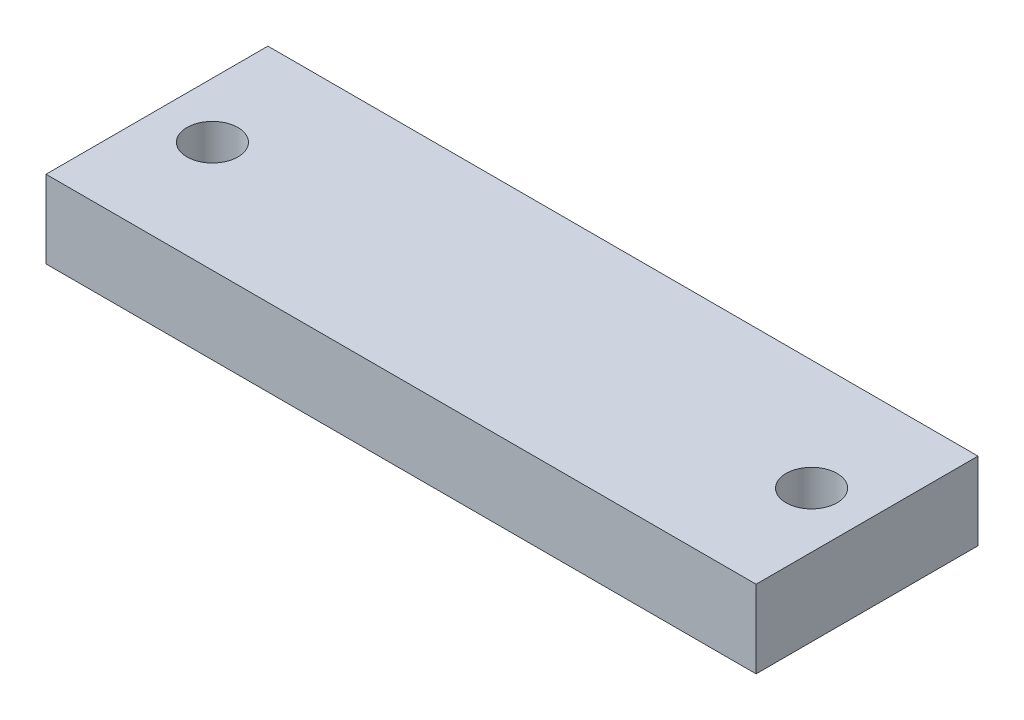
ISO-10303-21;
HEADER;
FILE_DESCRIPTION(('STEP AP214'),'2;1');
FILE_NAME('part.step','',(''),(''),'','','');
FILE_SCHEMA(('AUTOMOTIVE_DESIGN { 1 0 10303 214 1 1 1 1 }'));
ENDSEC;
DATA;
#1=APPLICATION_CONTEXT('core data for automotive mechanical design processes');
#2=APPLICATION_PROTOCOL_DEFINITION('international standard','automotive_design',2000,#1);
#3=PRODUCT_CONTEXT('',#1,'mechanical');
#4=PRODUCT('Part','Part','',(#3));
#5=PRODUCT_RELATED_PRODUCT_CATEGORY('part','',(#4));
#6=PRODUCT_DEFINITION_FORMATION('','',#4);
#7=PRODUCT_DEFINITION_CONTEXT('part definition',#1,'design');
#8=PRODUCT_DEFINITION('design','',#6,#7);
#9=PRODUCT_DEFINITION_SHAPE('','',#8);
#10=(LENGTH_UNIT() NAMED_UNIT(*) SI_UNIT(.MILLI.,.METRE.));
#11=(NAMED_UNIT(*) PLANE_ANGLE_UNIT() SI_UNIT($,.RADIAN.));
#12=(NAMED_UNIT(*) SI_UNIT($,.STERADIAN.) SOLID_ANGLE_UNIT());
#13=UNCERTAINTY_MEASURE_WITH_UNIT(LENGTH_MEASURE(1.E-05),#10,'distance_accuracy_value','');
#14=(GEOMETRIC_REPRESENTATION_CONTEXT(3) GLOBAL_UNCERTAINTY_ASSIGNED_CONTEXT((#13)) GLOBAL_UNIT_ASSIGNED_CONTEXT((#10,
#11,#12)) REPRESENTATION_CONTEXT('',''));
#15=CARTESIAN_POINT('',(0.,0.,0.));
#16=DIRECTION('',(0.,0.,1.));
#17=DIRECTION('',(1.,0.,0.));
#18=AXIS2_PLACEMENT_3D('',#15,#16,#17);
#19=CARTESIAN_POINT('',(0.,7.,0.));
#20=DIRECTION('',(0.,0.,-1.));
#21=DIRECTION('',(-1.,0.,0.));
#22=AXIS2_PLACEMENT_3D('',#19,#20,#21);
#23=PLANE('',#22);
#24=DIRECTION('',(1.,0.,0.));
#25=VECTOR('',#24,1.);
#26=CARTESIAN_POINT('',(0.,0.,0.));
#27=LINE('',#26,#25);
#28=CARTESIAN_POINT('',(0.,0.,0.));
#29=VERTEX_POINT('',#28);
#30=CARTESIAN_POINT('',(64.,0.,0.));
#31=VERTEX_POINT('',#30);
#32=EDGE_CURVE('E122',#29,#31,#27,.T.);
#33=ORIENTED_EDGE('',*,*,#32,.T.);
#34=DIRECTION('',(0.,-1.,0.));
#35=VECTOR('',#34,1.);
#36=CARTESIAN_POINT('',(64.,7.,0.));
#37=LINE('',#36,#35);
#38=CARTESIAN_POINT('',(64.,7.,0.));
#39=VERTEX_POINT('',#38);
#40=EDGE_CURVE('E11',#39,#31,#37,.T.);
#41=ORIENTED_EDGE('',*,*,#40,.F.);
#42=DIRECTION('',(1.,0.,0.));
#43=VECTOR('',#42,1.);
#44=CARTESIAN_POINT('',(0.,7.,0.));
#45=LINE('',#44,#43);
#46=CARTESIAN_POINT('',(0.,7.,0.));
#47=VERTEX_POINT('',#46);
#48=EDGE_CURVE('E96',#47,#39,#45,.T.);
#49=ORIENTED_EDGE('',*,*,#48,.F.);
#50=DIRECTION('',(0.,-1.,0.));
#51=VECTOR('',#50,1.);
#52=CARTESIAN_POINT('',(0.,7.,0.));
#53=LINE('',#52,#51);
#54=EDGE_CURVE('E63',#47,#29,#53,.T.);
#55=ORIENTED_EDGE('',*,*,#54,.T.);
#56=EDGE_LOOP('',(#33,#41,#49,#55));
#57=FACE_BOUND('',#56,.T.);
#58=ADVANCED_FACE('F45',(#57),#23,.F.);
#59=CARTESIAN_POINT('',(64.,7.,0.));
#60=DIRECTION('',(-1.,0.,0.));
#61=DIRECTION('',(0.,0.,1.));
#62=AXIS2_PLACEMENT_3D('',#59,#60,#61);
#63=PLANE('',#62);
#64=DIRECTION('',(0.,0.,-1.));
#65=VECTOR('',#64,1.);
#66=CARTESIAN_POINT('',(64.,0.,0.));
#67=LINE('',#66,#65);
#68=CARTESIAN_POINT('',(64.,0.,-20.));
#69=VERTEX_POINT('',#68);
#70=EDGE_CURVE('E102',#31,#69,#67,.T.);
#71=ORIENTED_EDGE('',*,*,#70,.T.);
#72=DIRECTION('',(0.,-1.,0.));
#73=VECTOR('',#72,1.);
#74=CARTESIAN_POINT('',(64.,7.,-20.));
#75=LINE('',#74,#73);
#76=CARTESIAN_POINT('',(64.,7.,-20.));
#77=VERTEX_POINT('',#76);
#78=EDGE_CURVE('E55',#77,#69,#75,.T.);
#79=ORIENTED_EDGE('',*,*,#78,.F.);
#80=DIRECTION('',(0.,0.,-1.));
#81=VECTOR('',#80,1.);
#82=CARTESIAN_POINT('',(64.,7.,0.));
#83=LINE('',#82,#81);
#84=EDGE_CURVE('E88',#39,#77,#83,.T.);
#85=ORIENTED_EDGE('',*,*,#84,.F.);
#86=ORIENTED_EDGE('',*,*,#40,.T.);
#87=EDGE_LOOP('',(#71,#79,#85,#86));
#88=FACE_BOUND('',#87,.T.);
#89=ADVANCED_FACE('F101',(#88),#63,.F.);
#90=CARTESIAN_POINT('',(0.,7.,-20.));
#91=DIRECTION('',(0.,0.,-1.));
#92=DIRECTION('',(-1.,0.,0.));
#93=AXIS2_PLACEMENT_3D('',#90,#91,#92);
#94=PLANE('',#93);
#95=DIRECTION('',(1.,0.,0.));
#96=VECTOR('',#95,1.);
#97=CARTESIAN_POINT('',(0.,0.,-20.));
#98=LINE('',#97,#96);
#99=CARTESIAN_POINT('',(0.,0.,-20.));
#100=VERTEX_POINT('',#99);
#101=EDGE_CURVE('E127',#100,#69,#98,.T.);
#102=ORIENTED_EDGE('',*,*,#101,.F.);
#103=DIRECTION('',(0.,-1.,0.));
#104=VECTOR('',#103,1.);
#105=CARTESIAN_POINT('',(0.,7.,-20.));
#106=LINE('',#105,#104);
#107=CARTESIAN_POINT('',(0.,7.,-20.));
#108=VERTEX_POINT('',#107);
#109=EDGE_CURVE('E77',#108,#100,#106,.T.);
#110=ORIENTED_EDGE('',*,*,#109,.F.);
#111=DIRECTION('',(1.,0.,0.));
#112=VECTOR('',#111,1.);
#113=CARTESIAN_POINT('',(0.,7.,-20.));
#114=LINE('',#113,#112);
#115=EDGE_CURVE('E95',#108,#77,#114,.T.);
#116=ORIENTED_EDGE('',*,*,#115,.T.);
#117=ORIENTED_EDGE('',*,*,#78,.T.);
#118=EDGE_LOOP('',(#102,#110,#116,#117));
#119=FACE_BOUND('',#118,.T.);
#120=ADVANCED_FACE('F106',(#119),#94,.T.);
#121=CARTESIAN_POINT('',(5.,7.,-10.));
#122=DIRECTION('',(0.,-1.,0.));
#123=DIRECTION('',(0.,0.,-1.));
#124=AXIS2_PLACEMENT_3D('',#121,#122,#123);
#125=CYLINDRICAL_SURFACE('',#124,2.3);
#126=CARTESIAN_POINT('',(5.,7.,-10.));
#127=DIRECTION('',(0.,1.,0.));
#128=DIRECTION('',(0.,0.,1.));
#129=AXIS2_PLACEMENT_3D('',#126,#127,#128);
#130=CIRCLE('',#129,2.3);
#131=CARTESIAN_POINT('',(5.,7.,-7.7));
#132=VERTEX_POINT('',#131);
#133=EDGE_CURVE('E141',#132,#132,#130,.T.);
#134=ORIENTED_EDGE('',*,*,#133,.T.);
#135=EDGE_LOOP('',(#134));
#136=FACE_BOUND('',#135,.T.);
#137=CARTESIAN_POINT('',(5.,0.,-10.));
#138=DIRECTION('',(0.,1.,0.));
#139=DIRECTION('',(0.,0.,1.));
#140=AXIS2_PLACEMENT_3D('',#137,#138,#139);
#141=CIRCLE('',#140,2.3);
#142=CARTESIAN_POINT('',(5.,0.,-7.7));
#143=VERTEX_POINT('',#142);
#144=EDGE_CURVE('E118',#143,#143,#141,.T.);
#145=ORIENTED_EDGE('',*,*,#144,.F.);
#146=EDGE_LOOP('',(#145));
#147=FACE_BOUND('',#146,.T.);
#148=ADVANCED_FACE('F151',(#136,#147),#125,.F.);
#149=CARTESIAN_POINT('',(59.,7.,-10.));
#150=DIRECTION('',(0.,-1.,0.));
#151=DIRECTION('',(0.,0.,-1.));
#152=AXIS2_PLACEMENT_3D('',#149,#150,#151);
#153=CYLINDRICAL_SURFACE('',#152,2.3);
#154=CARTESIAN_POINT('',(59.,7.,-10.));
#155=DIRECTION('',(0.,1.,0.));
#156=DIRECTION('',(0.,0.,1.));
#157=AXIS2_PLACEMENT_3D('',#154,#155,#156);
#158=CIRCLE('',#157,2.3);
#159=CARTESIAN_POINT('',(59.,7.,-7.7));
#160=VERTEX_POINT('',#159);
#161=EDGE_CURVE('E134',#160,#160,#158,.T.);
#162=ORIENTED_EDGE('',*,*,#161,.T.);
#163=EDGE_LOOP('',(#162));
#164=FACE_BOUND('',#163,.T.);
#165=CARTESIAN_POINT('',(59.,0.,-10.));
#166=DIRECTION('',(0.,1.,0.));
#167=DIRECTION('',(0.,0.,1.));
#168=AXIS2_PLACEMENT_3D('',#165,#166,#167);
#169=CIRCLE('',#168,2.3);
#170=CARTESIAN_POINT('',(59.,0.,-7.7));
#171=VERTEX_POINT('',#170);
#172=EDGE_CURVE('E114',#171,#171,#169,.T.);
#173=ORIENTED_EDGE('',*,*,#172,.F.);
#174=EDGE_LOOP('',(#173));
#175=FACE_BOUND('',#174,.T.);
#176=ADVANCED_FACE('F47',(#164,#175),#153,.F.);
#177=CARTESIAN_POINT('',(0.,7.,0.));
#178=DIRECTION('',(-1.,0.,0.));
#179=DIRECTION('',(0.,0.,1.));
#180=AXIS2_PLACEMENT_3D('',#177,#178,#179);
#181=PLANE('',#180);
#182=DIRECTION('',(0.,0.,-1.));
#183=VECTOR('',#182,1.);
#184=CARTESIAN_POINT('',(0.,0.,0.));
#185=LINE('',#184,#183);
#186=EDGE_CURVE('E130',#29,#100,#185,.T.);
#187=ORIENTED_EDGE('',*,*,#186,.F.);
#188=ORIENTED_EDGE('',*,*,#54,.F.);
#189=DIRECTION('',(0.,0.,-1.));
#190=VECTOR('',#189,1.);
#191=CARTESIAN_POINT('',(0.,7.,0.));
#192=LINE('',#191,#190);
#193=EDGE_CURVE('E108',#47,#108,#192,.T.);
#194=ORIENTED_EDGE('',*,*,#193,.T.);
#195=ORIENTED_EDGE('',*,*,#109,.T.);
#196=EDGE_LOOP('',(#187,#188,#194,#195));
#197=FACE_BOUND('',#196,.T.);
#198=ADVANCED_FACE('F156',(#197),#181,.T.);
#199=CARTESIAN_POINT('',(0.,7.,0.));
#200=DIRECTION('',(0.,1.,0.));
#201=DIRECTION('',(0.,0.,1.));
#202=AXIS2_PLACEMENT_3D('',#199,#200,#201);
#203=PLANE('',#202);
#204=ORIENTED_EDGE('',*,*,#161,.F.);
#205=EDGE_LOOP('',(#204));
#206=FACE_BOUND('',#205,.T.);
#207=ORIENTED_EDGE('',*,*,#133,.F.);
#208=EDGE_LOOP('',(#207));
#209=FACE_BOUND('',#208,.T.);
#210=ORIENTED_EDGE('',*,*,#48,.T.);
#211=ORIENTED_EDGE('',*,*,#84,.T.);
#212=ORIENTED_EDGE('',*,*,#115,.F.);
#213=ORIENTED_EDGE('',*,*,#193,.F.);
#214=EDGE_LOOP('',(#210,#211,#212,#213));
#215=FACE_BOUND('',#214,.T.);
#216=ADVANCED_FACE('F92',(#206,#209,#215),#203,.T.);
#217=CARTESIAN_POINT('',(0.,0.,0.));
#218=DIRECTION('',(0.,1.,0.));
#219=DIRECTION('',(0.,0.,1.));
#220=AXIS2_PLACEMENT_3D('',#217,#218,#219);
#221=PLANE('',#220);
#222=ORIENTED_EDGE('',*,*,#172,.T.);
#223=EDGE_LOOP('',(#222));
#224=FACE_BOUND('',#223,.T.);
#225=ORIENTED_EDGE('',*,*,#144,.T.);
#226=EDGE_LOOP('',(#225));
#227=FACE_BOUND('',#226,.T.);
#228=ORIENTED_EDGE('',*,*,#32,.F.);
#229=ORIENTED_EDGE('',*,*,#186,.T.);
#230=ORIENTED_EDGE('',*,*,#101,.T.);
#231=ORIENTED_EDGE('',*,*,#70,.F.);
#232=EDGE_LOOP('',(#228,#229,#230,#231));
#233=FACE_BOUND('',#232,.T.);
#234=ADVANCED_FACE('F155',(#224,#227,#233),#221,.F.);
#235=CLOSED_SHELL('',(#58,#89,#120,#148,#176,#198,#216,#234));
#236=MANIFOLD_SOLID_BREP('B2',#235);
#237=ADVANCED_BREP_SHAPE_REPRESENTATION('',(#18,#236),#14);
#238=SHAPE_DEFINITION_REPRESENTATION(#9,#237);
ENDSEC;
END-ISO-10303-21;
